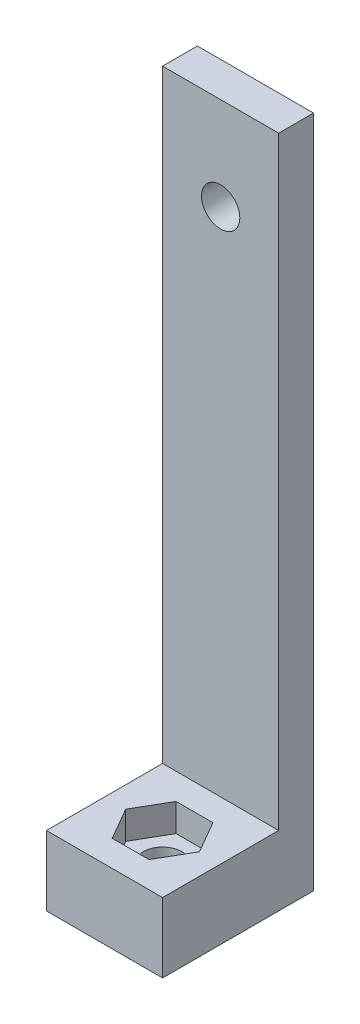
ISO-10303-21;
HEADER;
FILE_DESCRIPTION(('STEP AP214'),'2;1');
FILE_NAME('part.step','',(''),(''),'','','');
FILE_SCHEMA(('AUTOMOTIVE_DESIGN { 1 0 10303 214 1 1 1 1 }'));
ENDSEC;
DATA;
#1=APPLICATION_CONTEXT('core data for automotive mechanical design processes');
#2=APPLICATION_PROTOCOL_DEFINITION('international standard','automotive_design',2000,#1);
#3=PRODUCT_CONTEXT('',#1,'mechanical');
#4=PRODUCT('Part','Part','',(#3));
#5=PRODUCT_RELATED_PRODUCT_CATEGORY('part','',(#4));
#6=PRODUCT_DEFINITION_FORMATION('','',#4);
#7=PRODUCT_DEFINITION_CONTEXT('part definition',#1,'design');
#8=PRODUCT_DEFINITION('design','',#6,#7);
#9=PRODUCT_DEFINITION_SHAPE('','',#8);
#10=(LENGTH_UNIT() NAMED_UNIT(*) SI_UNIT(.MILLI.,.METRE.));
#11=(NAMED_UNIT(*) PLANE_ANGLE_UNIT() SI_UNIT($,.RADIAN.));
#12=(NAMED_UNIT(*) SI_UNIT($,.STERADIAN.) SOLID_ANGLE_UNIT());
#13=UNCERTAINTY_MEASURE_WITH_UNIT(LENGTH_MEASURE(1.E-05),#10,'distance_accuracy_value','');
#14=(GEOMETRIC_REPRESENTATION_CONTEXT(3) GLOBAL_UNCERTAINTY_ASSIGNED_CONTEXT((#13)) GLOBAL_UNIT_ASSIGNED_CONTEXT((#10,
#11,#12)) REPRESENTATION_CONTEXT('',''));
#15=CARTESIAN_POINT('',(0.,0.,0.));
#16=DIRECTION('',(0.,0.,1.));
#17=DIRECTION('',(1.,0.,0.));
#18=AXIS2_PLACEMENT_3D('',#15,#16,#17);
#19=CARTESIAN_POINT('',(0.,6.,0.));
#20=DIRECTION('',(0.,-1.,0.));
#21=DIRECTION('',(0.,0.,-1.));
#22=AXIS2_PLACEMENT_3D('',#19,#20,#21);
#23=CYLINDRICAL_SURFACE('',#22,1.65);
#24=CARTESIAN_POINT('',(0.,0.,0.));
#25=DIRECTION('',(0.,1.,0.));
#26=DIRECTION('',(0.,0.,1.));
#27=AXIS2_PLACEMENT_3D('',#24,#25,#26);
#28=CIRCLE('',#27,1.65);
#29=CARTESIAN_POINT('',(0.,0.,1.65));
#30=VERTEX_POINT('',#29);
#31=EDGE_CURVE('E203',#30,#30,#28,.T.);
#32=ORIENTED_EDGE('',*,*,#31,.F.);
#33=EDGE_LOOP('',(#32));
#34=FACE_BOUND('',#33,.T.);
#35=CARTESIAN_POINT('',(0.,3.6,0.));
#36=DIRECTION('',(0.,1.,0.));
#37=DIRECTION('',(0.,0.,1.));
#38=AXIS2_PLACEMENT_3D('',#35,#36,#37);
#39=CIRCLE('',#38,1.65);
#40=CARTESIAN_POINT('',(0.,3.6,1.65));
#41=VERTEX_POINT('',#40);
#42=EDGE_CURVE('E41',#41,#41,#39,.T.);
#43=ORIENTED_EDGE('',*,*,#42,.T.);
#44=EDGE_LOOP('',(#43));
#45=FACE_BOUND('',#44,.T.);
#46=ADVANCED_FACE('F37',(#34,#45),#23,.F.);
#47=CARTESIAN_POINT('',(0.,6.,0.));
#48=DIRECTION('',(0.,1.,0.));
#49=DIRECTION('',(0.,0.,1.));
#50=AXIS2_PLACEMENT_3D('',#47,#48,#49);
#51=PLANE('',#50);
#52=DIRECTION('',(1.,0.,0.));
#53=VECTOR('',#52,1.);
#54=CARTESIAN_POINT('',(0.,6.,-5.));
#55=LINE('',#54,#53);
#56=CARTESIAN_POINT('',(-5.,6.,-5.));
#57=VERTEX_POINT('',#56);
#58=CARTESIAN_POINT('',(5.,6.,-5.));
#59=VERTEX_POINT('',#58);
#60=EDGE_CURVE('E53',#57,#59,#55,.T.);
#61=ORIENTED_EDGE('',*,*,#60,.F.);
#62=DIRECTION('',(0.,0.,1.));
#63=VECTOR('',#62,1.);
#64=CARTESIAN_POINT('',(-5.,6.,-8.));
#65=LINE('',#64,#63);
#66=CARTESIAN_POINT('',(-5.,6.,5.));
#67=VERTEX_POINT('',#66);
#68=EDGE_CURVE('E131',#57,#67,#65,.T.);
#69=ORIENTED_EDGE('',*,*,#68,.T.);
#70=DIRECTION('',(1.,0.,0.));
#71=VECTOR('',#70,1.);
#72=CARTESIAN_POINT('',(-5.,6.,5.));
#73=LINE('',#72,#71);
#74=CARTESIAN_POINT('',(5.,6.,5.));
#75=VERTEX_POINT('',#74);
#76=EDGE_CURVE('E208',#67,#75,#73,.T.);
#77=ORIENTED_EDGE('',*,*,#76,.T.);
#78=DIRECTION('',(0.,0.,-1.));
#79=VECTOR('',#78,1.);
#80=CARTESIAN_POINT('',(5.,6.,5.));
#81=LINE('',#80,#79);
#82=EDGE_CURVE('E58',#75,#59,#81,.T.);
#83=ORIENTED_EDGE('',*,*,#82,.T.);
#84=EDGE_LOOP('',(#61,#69,#77,#83));
#85=FACE_BOUND('',#84,.T.);
#86=DIRECTION('',(0.5,0.,-0.866025403784439));
#87=VECTOR('',#86,1.);
#88=CARTESIAN_POINT('',(1.58771324027147,6.,2.75));
#89=LINE('',#88,#87);
#90=CARTESIAN_POINT('',(1.58771324027147,6.,2.75));
#91=VERTEX_POINT('',#90);
#92=CARTESIAN_POINT('',(3.17542648054294,6.,0.));
#93=VERTEX_POINT('',#92);
#94=EDGE_CURVE('E155',#91,#93,#89,.T.);
#95=ORIENTED_EDGE('',*,*,#94,.F.);
#96=DIRECTION('',(1.,0.,0.));
#97=VECTOR('',#96,1.);
#98=CARTESIAN_POINT('',(-1.58771324027147,6.,2.75));
#99=LINE('',#98,#97);
#100=CARTESIAN_POINT('',(-1.58771324027147,6.,2.75));
#101=VERTEX_POINT('',#100);
#102=EDGE_CURVE('E160',#101,#91,#99,.T.);
#103=ORIENTED_EDGE('',*,*,#102,.F.);
#104=DIRECTION('',(0.5,0.,0.866025403784438));
#105=VECTOR('',#104,1.);
#106=CARTESIAN_POINT('',(-3.17542648054294,6.,0.));
#107=LINE('',#106,#105);
#108=CARTESIAN_POINT('',(-3.17542648054294,6.,0.));
#109=VERTEX_POINT('',#108);
#110=EDGE_CURVE('E186',#109,#101,#107,.T.);
#111=ORIENTED_EDGE('',*,*,#110,.F.);
#112=DIRECTION('',(-0.5,0.,0.866025403784438));
#113=VECTOR('',#112,1.);
#114=CARTESIAN_POINT('',(-1.58771324027147,6.,-2.75));
#115=LINE('',#114,#113);
#116=CARTESIAN_POINT('',(-1.58771324027147,6.,-2.75));
#117=VERTEX_POINT('',#116);
#118=EDGE_CURVE('E183',#117,#109,#115,.T.);
#119=ORIENTED_EDGE('',*,*,#118,.F.);
#120=DIRECTION('',(-1.,0.,0.));
#121=VECTOR('',#120,1.);
#122=CARTESIAN_POINT('',(1.58771324027147,6.,-2.75));
#123=LINE('',#122,#121);
#124=CARTESIAN_POINT('',(1.58771324027147,6.,-2.75));
#125=VERTEX_POINT('',#124);
#126=EDGE_CURVE('E180',#125,#117,#123,.T.);
#127=ORIENTED_EDGE('',*,*,#126,.F.);
#128=DIRECTION('',(-0.5,0.,-0.866025403784438));
#129=VECTOR('',#128,1.);
#130=CARTESIAN_POINT('',(3.17542648054294,6.,0.));
#131=LINE('',#130,#129);
#132=EDGE_CURVE('E177',#93,#125,#131,.T.);
#133=ORIENTED_EDGE('',*,*,#132,.F.);
#134=EDGE_LOOP('',(#95,#103,#111,#119,#127,#133));
#135=FACE_BOUND('',#134,.T.);
#136=ADVANCED_FACE('F239',(#85,#135),#51,.T.);
#137=CARTESIAN_POINT('',(0.,0.,0.));
#138=DIRECTION('',(0.,1.,0.));
#139=DIRECTION('',(0.,0.,1.));
#140=AXIS2_PLACEMENT_3D('',#137,#138,#139);
#141=PLANE('',#140);
#142=DIRECTION('',(1.,0.,0.));
#143=VECTOR('',#142,1.);
#144=CARTESIAN_POINT('',(-5.,0.,5.));
#145=LINE('',#144,#143);
#146=CARTESIAN_POINT('',(-5.,0.,5.));
#147=VERTEX_POINT('',#146);
#148=CARTESIAN_POINT('',(5.,0.,5.));
#149=VERTEX_POINT('',#148);
#150=EDGE_CURVE('E214',#147,#149,#145,.T.);
#151=ORIENTED_EDGE('',*,*,#150,.F.);
#152=DIRECTION('',(0.,0.,1.));
#153=VECTOR('',#152,1.);
#154=CARTESIAN_POINT('',(-5.,0.,-8.));
#155=LINE('',#154,#153);
#156=CARTESIAN_POINT('',(-5.,0.,-8.));
#157=VERTEX_POINT('',#156);
#158=EDGE_CURVE('E206',#157,#147,#155,.T.);
#159=ORIENTED_EDGE('',*,*,#158,.F.);
#160=DIRECTION('',(-1.,0.,0.));
#161=VECTOR('',#160,1.);
#162=CARTESIAN_POINT('',(5.,0.,-8.));
#163=LINE('',#162,#161);
#164=CARTESIAN_POINT('',(5.,0.,-8.));
#165=VERTEX_POINT('',#164);
#166=EDGE_CURVE('E209',#165,#157,#163,.T.);
#167=ORIENTED_EDGE('',*,*,#166,.F.);
#168=DIRECTION('',(0.,0.,-1.));
#169=VECTOR('',#168,1.);
#170=CARTESIAN_POINT('',(5.,0.,5.));
#171=LINE('',#170,#169);
#172=EDGE_CURVE('E216',#149,#165,#171,.T.);
#173=ORIENTED_EDGE('',*,*,#172,.F.);
#174=EDGE_LOOP('',(#151,#159,#167,#173));
#175=FACE_BOUND('',#174,.T.);
#176=ORIENTED_EDGE('',*,*,#31,.T.);
#177=EDGE_LOOP('',(#176));
#178=FACE_BOUND('',#177,.T.);
#179=ADVANCED_FACE('F233',(#175,#178),#141,.F.);
#180=CARTESIAN_POINT('',(-5.,6.,-8.));
#181=DIRECTION('',(1.,0.,0.));
#182=DIRECTION('',(0.,0.,-1.));
#183=AXIS2_PLACEMENT_3D('',#180,#181,#182);
#184=PLANE('',#183);
#185=ORIENTED_EDGE('',*,*,#68,.F.);
#186=DIRECTION('',(0.,1.,0.));
#187=VECTOR('',#186,1.);
#188=CARTESIAN_POINT('',(-5.,0.,-5.));
#189=LINE('',#188,#187);
#190=CARTESIAN_POINT('',(-5.,58.,-5.));
#191=VERTEX_POINT('',#190);
#192=EDGE_CURVE('E125',#57,#191,#189,.T.);
#193=ORIENTED_EDGE('',*,*,#192,.T.);
#194=DIRECTION('',(0.,0.,-1.));
#195=VECTOR('',#194,1.);
#196=CARTESIAN_POINT('',(-5.,58.,-5.));
#197=LINE('',#196,#195);
#198=CARTESIAN_POINT('',(-5.,58.,-8.));
#199=VERTEX_POINT('',#198);
#200=EDGE_CURVE('E128',#191,#199,#197,.T.);
#201=ORIENTED_EDGE('',*,*,#200,.T.);
#202=DIRECTION('',(0.,-1.,0.));
#203=VECTOR('',#202,1.);
#204=CARTESIAN_POINT('',(-5.,6.,-8.));
#205=LINE('',#204,#203);
#206=EDGE_CURVE('E212',#199,#157,#205,.T.);
#207=ORIENTED_EDGE('',*,*,#206,.T.);
#208=ORIENTED_EDGE('',*,*,#158,.T.);
#209=DIRECTION('',(0.,-1.,0.));
#210=VECTOR('',#209,1.);
#211=CARTESIAN_POINT('',(-5.,6.,5.));
#212=LINE('',#211,#210);
#213=EDGE_CURVE('E11',#67,#147,#212,.T.);
#214=ORIENTED_EDGE('',*,*,#213,.F.);
#215=EDGE_LOOP('',(#185,#193,#201,#207,#208,#214));
#216=FACE_BOUND('',#215,.T.);
#217=ADVANCED_FACE('F39',(#216),#184,.F.);
#218=CARTESIAN_POINT('',(-5.,6.,5.));
#219=DIRECTION('',(0.,0.,-1.));
#220=DIRECTION('',(-1.,0.,0.));
#221=AXIS2_PLACEMENT_3D('',#218,#219,#220);
#222=PLANE('',#221);
#223=ORIENTED_EDGE('',*,*,#150,.T.);
#224=DIRECTION('',(0.,-1.,0.));
#225=VECTOR('',#224,1.);
#226=CARTESIAN_POINT('',(5.,6.,5.));
#227=LINE('',#226,#225);
#228=EDGE_CURVE('E46',#75,#149,#227,.T.);
#229=ORIENTED_EDGE('',*,*,#228,.F.);
#230=ORIENTED_EDGE('',*,*,#76,.F.);
#231=ORIENTED_EDGE('',*,*,#213,.T.);
#232=EDGE_LOOP('',(#223,#229,#230,#231));
#233=FACE_BOUND('',#232,.T.);
#234=ADVANCED_FACE('F238',(#233),#222,.F.);
#235=CARTESIAN_POINT('',(5.,6.,5.));
#236=DIRECTION('',(-1.,0.,0.));
#237=DIRECTION('',(0.,0.,1.));
#238=AXIS2_PLACEMENT_3D('',#235,#236,#237);
#239=PLANE('',#238);
#240=ORIENTED_EDGE('',*,*,#172,.T.);
#241=DIRECTION('',(0.,-1.,0.));
#242=VECTOR('',#241,1.);
#243=CARTESIAN_POINT('',(5.,6.,-8.));
#244=LINE('',#243,#242);
#245=CARTESIAN_POINT('',(5.,58.,-8.));
#246=VERTEX_POINT('',#245);
#247=EDGE_CURVE('E220',#246,#165,#244,.T.);
#248=ORIENTED_EDGE('',*,*,#247,.F.);
#249=DIRECTION('',(0.,0.,-1.));
#250=VECTOR('',#249,1.);
#251=CARTESIAN_POINT('',(5.,58.,-5.));
#252=LINE('',#251,#250);
#253=CARTESIAN_POINT('',(5.,58.,-5.));
#254=VERTEX_POINT('',#253);
#255=EDGE_CURVE('E143',#254,#246,#252,.T.);
#256=ORIENTED_EDGE('',*,*,#255,.F.);
#257=DIRECTION('',(0.,-1.,0.));
#258=VECTOR('',#257,1.);
#259=CARTESIAN_POINT('',(5.,0.,-5.));
#260=LINE('',#259,#258);
#261=EDGE_CURVE('E135',#254,#59,#260,.T.);
#262=ORIENTED_EDGE('',*,*,#261,.T.);
#263=ORIENTED_EDGE('',*,*,#82,.F.);
#264=ORIENTED_EDGE('',*,*,#228,.T.);
#265=EDGE_LOOP('',(#240,#248,#256,#262,#263,#264));
#266=FACE_BOUND('',#265,.T.);
#267=ADVANCED_FACE('F227',(#266),#239,.F.);
#268=CARTESIAN_POINT('',(5.,6.,-8.));
#269=DIRECTION('',(0.,0.,1.));
#270=DIRECTION('',(1.,0.,0.));
#271=AXIS2_PLACEMENT_3D('',#268,#269,#270);
#272=PLANE('',#271);
#273=CARTESIAN_POINT('',(0.,50.,-8.));
#274=DIRECTION('',(0.,0.,1.));
#275=DIRECTION('',(1.,0.,0.));
#276=AXIS2_PLACEMENT_3D('',#273,#274,#275);
#277=CIRCLE('',#276,1.65);
#278=CARTESIAN_POINT('',(1.65,50.,-8.));
#279=VERTEX_POINT('',#278);
#280=EDGE_CURVE('E152',#279,#279,#277,.T.);
#281=ORIENTED_EDGE('',*,*,#280,.T.);
#282=EDGE_LOOP('',(#281));
#283=FACE_BOUND('',#282,.T.);
#284=ORIENTED_EDGE('',*,*,#166,.T.);
#285=ORIENTED_EDGE('',*,*,#206,.F.);
#286=DIRECTION('',(1.,0.,0.));
#287=VECTOR('',#286,1.);
#288=CARTESIAN_POINT('',(5.,58.,-8.));
#289=LINE('',#288,#287);
#290=EDGE_CURVE('E142',#199,#246,#289,.T.);
#291=ORIENTED_EDGE('',*,*,#290,.T.);
#292=ORIENTED_EDGE('',*,*,#247,.T.);
#293=EDGE_LOOP('',(#284,#285,#291,#292));
#294=FACE_BOUND('',#293,.T.);
#295=ADVANCED_FACE('F237',(#283,#294),#272,.F.);
#296=CARTESIAN_POINT('',(1.58771324027147,3.6,2.75));
#297=DIRECTION('',(0.866025403784439,0.,0.5));
#298=DIRECTION('',(0.5,0.,-0.866025403784439));
#299=AXIS2_PLACEMENT_3D('',#296,#297,#298);
#300=PLANE('',#299);
#301=ORIENTED_EDGE('',*,*,#94,.T.);
#302=DIRECTION('',(0.,1.,0.));
#303=VECTOR('',#302,1.);
#304=CARTESIAN_POINT('',(3.17542648054294,3.6,0.));
#305=LINE('',#304,#303);
#306=CARTESIAN_POINT('',(3.17542648054294,3.6,0.));
#307=VERTEX_POINT('',#306);
#308=EDGE_CURVE('E175',#307,#93,#305,.T.);
#309=ORIENTED_EDGE('',*,*,#308,.F.);
#310=DIRECTION('',(0.5,0.,-0.866025403784439));
#311=VECTOR('',#310,1.);
#312=CARTESIAN_POINT('',(1.58771324027147,3.6,2.75));
#313=LINE('',#312,#311);
#314=CARTESIAN_POINT('',(1.58771324027147,3.6,2.75));
#315=VERTEX_POINT('',#314);
#316=EDGE_CURVE('E156',#315,#307,#313,.T.);
#317=ORIENTED_EDGE('',*,*,#316,.F.);
#318=DIRECTION('',(0.,1.,0.));
#319=VECTOR('',#318,1.);
#320=CARTESIAN_POINT('',(1.58771324027147,3.6,2.75));
#321=LINE('',#320,#319);
#322=EDGE_CURVE('E191',#315,#91,#321,.T.);
#323=ORIENTED_EDGE('',*,*,#322,.T.);
#324=EDGE_LOOP('',(#301,#309,#317,#323));
#325=FACE_BOUND('',#324,.T.);
#326=ADVANCED_FACE('F249',(#325),#300,.F.);
#327=CARTESIAN_POINT('',(-1.58771324027147,3.6,2.75));
#328=DIRECTION('',(0.,0.,1.));
#329=DIRECTION('',(1.,0.,0.));
#330=AXIS2_PLACEMENT_3D('',#327,#328,#329);
#331=PLANE('',#330);
#332=ORIENTED_EDGE('',*,*,#102,.T.);
#333=ORIENTED_EDGE('',*,*,#322,.F.);
#334=DIRECTION('',(1.,0.,0.));
#335=VECTOR('',#334,1.);
#336=CARTESIAN_POINT('',(-1.58771324027147,3.6,2.75));
#337=LINE('',#336,#335);
#338=CARTESIAN_POINT('',(-1.58771324027147,3.6,2.75));
#339=VERTEX_POINT('',#338);
#340=EDGE_CURVE('E172',#339,#315,#337,.T.);
#341=ORIENTED_EDGE('',*,*,#340,.F.);
#342=DIRECTION('',(0.,1.,0.));
#343=VECTOR('',#342,1.);
#344=CARTESIAN_POINT('',(-1.58771324027147,3.6,2.75));
#345=LINE('',#344,#343);
#346=EDGE_CURVE('E193',#339,#101,#345,.T.);
#347=ORIENTED_EDGE('',*,*,#346,.T.);
#348=EDGE_LOOP('',(#332,#333,#341,#347));
#349=FACE_BOUND('',#348,.T.);
#350=ADVANCED_FACE('F260',(#349),#331,.F.);
#351=CARTESIAN_POINT('',(-3.17542648054294,3.6,0.));
#352=DIRECTION('',(-0.866025403784439,0.,0.5));
#353=DIRECTION('',(0.5,0.,0.866025403784439));
#354=AXIS2_PLACEMENT_3D('',#351,#352,#353);
#355=PLANE('',#354);
#356=ORIENTED_EDGE('',*,*,#110,.T.);
#357=ORIENTED_EDGE('',*,*,#346,.F.);
#358=DIRECTION('',(0.5,0.,0.866025403784438));
#359=VECTOR('',#358,1.);
#360=CARTESIAN_POINT('',(-3.17542648054294,3.6,0.));
#361=LINE('',#360,#359);
#362=CARTESIAN_POINT('',(-3.17542648054294,3.6,0.));
#363=VERTEX_POINT('',#362);
#364=EDGE_CURVE('E169',#363,#339,#361,.T.);
#365=ORIENTED_EDGE('',*,*,#364,.F.);
#366=DIRECTION('',(0.,1.,0.));
#367=VECTOR('',#366,1.);
#368=CARTESIAN_POINT('',(-3.17542648054294,3.6,0.));
#369=LINE('',#368,#367);
#370=EDGE_CURVE('E195',#363,#109,#369,.T.);
#371=ORIENTED_EDGE('',*,*,#370,.T.);
#372=EDGE_LOOP('',(#356,#357,#365,#371));
#373=FACE_BOUND('',#372,.T.);
#374=ADVANCED_FACE('F262',(#373),#355,.F.);
#375=CARTESIAN_POINT('',(-1.58771324027147,3.6,-2.75));
#376=DIRECTION('',(-0.866025403784439,0.,-0.5));
#377=DIRECTION('',(-0.5,0.,0.866025403784439));
#378=AXIS2_PLACEMENT_3D('',#375,#376,#377);
#379=PLANE('',#378);
#380=ORIENTED_EDGE('',*,*,#118,.T.);
#381=ORIENTED_EDGE('',*,*,#370,.F.);
#382=DIRECTION('',(-0.5,0.,0.866025403784438));
#383=VECTOR('',#382,1.);
#384=CARTESIAN_POINT('',(-1.58771324027147,3.6,-2.75));
#385=LINE('',#384,#383);
#386=CARTESIAN_POINT('',(-1.58771324027147,3.6,-2.75));
#387=VERTEX_POINT('',#386);
#388=EDGE_CURVE('E166',#387,#363,#385,.T.);
#389=ORIENTED_EDGE('',*,*,#388,.F.);
#390=DIRECTION('',(0.,1.,0.));
#391=VECTOR('',#390,1.);
#392=CARTESIAN_POINT('',(-1.58771324027147,3.6,-2.75));
#393=LINE('',#392,#391);
#394=EDGE_CURVE('E197',#387,#117,#393,.T.);
#395=ORIENTED_EDGE('',*,*,#394,.T.);
#396=EDGE_LOOP('',(#380,#381,#389,#395));
#397=FACE_BOUND('',#396,.T.);
#398=ADVANCED_FACE('F265',(#397),#379,.F.);
#399=CARTESIAN_POINT('',(1.58771324027147,3.6,-2.75));
#400=DIRECTION('',(0.,0.,-1.));
#401=DIRECTION('',(-1.,0.,0.));
#402=AXIS2_PLACEMENT_3D('',#399,#400,#401);
#403=PLANE('',#402);
#404=ORIENTED_EDGE('',*,*,#126,.T.);
#405=ORIENTED_EDGE('',*,*,#394,.F.);
#406=DIRECTION('',(-1.,0.,0.));
#407=VECTOR('',#406,1.);
#408=CARTESIAN_POINT('',(1.58771324027147,3.6,-2.75));
#409=LINE('',#408,#407);
#410=CARTESIAN_POINT('',(1.58771324027147,3.6,-2.75));
#411=VERTEX_POINT('',#410);
#412=EDGE_CURVE('E163',#411,#387,#409,.T.);
#413=ORIENTED_EDGE('',*,*,#412,.F.);
#414=DIRECTION('',(0.,1.,0.));
#415=VECTOR('',#414,1.);
#416=CARTESIAN_POINT('',(1.58771324027147,3.6,-2.75));
#417=LINE('',#416,#415);
#418=EDGE_CURVE('E199',#411,#125,#417,.T.);
#419=ORIENTED_EDGE('',*,*,#418,.T.);
#420=EDGE_LOOP('',(#404,#405,#413,#419));
#421=FACE_BOUND('',#420,.T.);
#422=ADVANCED_FACE('F268',(#421),#403,.F.);
#423=CARTESIAN_POINT('',(3.17542648054294,3.6,0.));
#424=DIRECTION('',(0.866025403784438,0.,-0.5));
#425=DIRECTION('',(-0.5,0.,-0.866025403784439));
#426=AXIS2_PLACEMENT_3D('',#423,#424,#425);
#427=PLANE('',#426);
#428=ORIENTED_EDGE('',*,*,#132,.T.);
#429=ORIENTED_EDGE('',*,*,#418,.F.);
#430=DIRECTION('',(-0.5,0.,-0.866025403784438));
#431=VECTOR('',#430,1.);
#432=CARTESIAN_POINT('',(3.17542648054294,3.6,0.));
#433=LINE('',#432,#431);
#434=EDGE_CURVE('E159',#307,#411,#433,.T.);
#435=ORIENTED_EDGE('',*,*,#434,.F.);
#436=ORIENTED_EDGE('',*,*,#308,.T.);
#437=EDGE_LOOP('',(#428,#429,#435,#436));
#438=FACE_BOUND('',#437,.T.);
#439=ADVANCED_FACE('F253',(#438),#427,.F.);
#440=CARTESIAN_POINT('',(0.,3.6,0.));
#441=DIRECTION('',(0.,1.,0.));
#442=DIRECTION('',(0.,0.,1.));
#443=AXIS2_PLACEMENT_3D('',#440,#441,#442);
#444=PLANE('',#443);
#445=ORIENTED_EDGE('',*,*,#42,.F.);
#446=EDGE_LOOP('',(#445));
#447=FACE_BOUND('',#446,.T.);
#448=ORIENTED_EDGE('',*,*,#316,.T.);
#449=ORIENTED_EDGE('',*,*,#434,.T.);
#450=ORIENTED_EDGE('',*,*,#412,.T.);
#451=ORIENTED_EDGE('',*,*,#388,.T.);
#452=ORIENTED_EDGE('',*,*,#364,.T.);
#453=ORIENTED_EDGE('',*,*,#340,.T.);
#454=EDGE_LOOP('',(#448,#449,#450,#451,#452,#453));
#455=FACE_BOUND('',#454,.T.);
#456=ADVANCED_FACE('F256',(#447,#455),#444,.T.);
#457=CARTESIAN_POINT('',(5.,58.,-5.));
#458=DIRECTION('',(0.,1.,0.));
#459=DIRECTION('',(0.,0.,1.));
#460=AXIS2_PLACEMENT_3D('',#457,#458,#459);
#461=PLANE('',#460);
#462=ORIENTED_EDGE('',*,*,#290,.F.);
#463=ORIENTED_EDGE('',*,*,#200,.F.);
#464=DIRECTION('',(1.,0.,0.));
#465=VECTOR('',#464,1.);
#466=CARTESIAN_POINT('',(5.,58.,-5.));
#467=LINE('',#466,#465);
#468=EDGE_CURVE('E134',#191,#254,#467,.T.);
#469=ORIENTED_EDGE('',*,*,#468,.T.);
#470=ORIENTED_EDGE('',*,*,#255,.T.);
#471=EDGE_LOOP('',(#462,#463,#469,#470));
#472=FACE_BOUND('',#471,.T.);
#473=ADVANCED_FACE('F139',(#472),#461,.T.);
#474=CARTESIAN_POINT('',(0.,0.,-5.));
#475=DIRECTION('',(0.,0.,1.));
#476=DIRECTION('',(1.,0.,0.));
#477=AXIS2_PLACEMENT_3D('',#474,#475,#476);
#478=PLANE('',#477);
#479=CARTESIAN_POINT('',(0.,50.,-5.));
#480=DIRECTION('',(0.,0.,1.));
#481=DIRECTION('',(1.,0.,0.));
#482=AXIS2_PLACEMENT_3D('',#479,#480,#481);
#483=CIRCLE('',#482,1.65);
#484=CARTESIAN_POINT('',(1.65,50.,-5.));
#485=VERTEX_POINT('',#484);
#486=EDGE_CURVE('E391',#485,#485,#483,.T.);
#487=ORIENTED_EDGE('',*,*,#486,.F.);
#488=EDGE_LOOP('',(#487));
#489=FACE_BOUND('',#488,.T.);
#490=ORIENTED_EDGE('',*,*,#192,.F.);
#491=ORIENTED_EDGE('',*,*,#60,.T.);
#492=ORIENTED_EDGE('',*,*,#261,.F.);
#493=ORIENTED_EDGE('',*,*,#468,.F.);
#494=EDGE_LOOP('',(#490,#491,#492,#493));
#495=FACE_BOUND('',#494,.T.);
#496=ADVANCED_FACE('F146',(#489,#495),#478,.T.);
#497=CARTESIAN_POINT('',(0.,50.,-8.));
#498=DIRECTION('',(0.,0.,1.));
#499=DIRECTION('',(1.,0.,0.));
#500=AXIS2_PLACEMENT_3D('',#497,#498,#499);
#501=CYLINDRICAL_SURFACE('',#500,1.65);
#502=ORIENTED_EDGE('',*,*,#280,.F.);
#503=EDGE_LOOP('',(#502));
#504=FACE_BOUND('',#503,.T.);
#505=ORIENTED_EDGE('',*,*,#486,.T.);
#506=EDGE_LOOP('',(#505));
#507=FACE_BOUND('',#506,.T.);
#508=ADVANCED_FACE('F325',(#504,#507),#501,.F.);
#509=CLOSED_SHELL('',(#46,#136,#179,#217,#234,#267,#295,#326,#350,#374,#398,#422,#439,#456,#473,
#496,#508));
#510=MANIFOLD_SOLID_BREP('B2',#509);
#511=ADVANCED_BREP_SHAPE_REPRESENTATION('',(#18,#510),#14);
#512=SHAPE_DEFINITION_REPRESENTATION(#9,#511);
ENDSEC;
END-ISO-10303-21;
